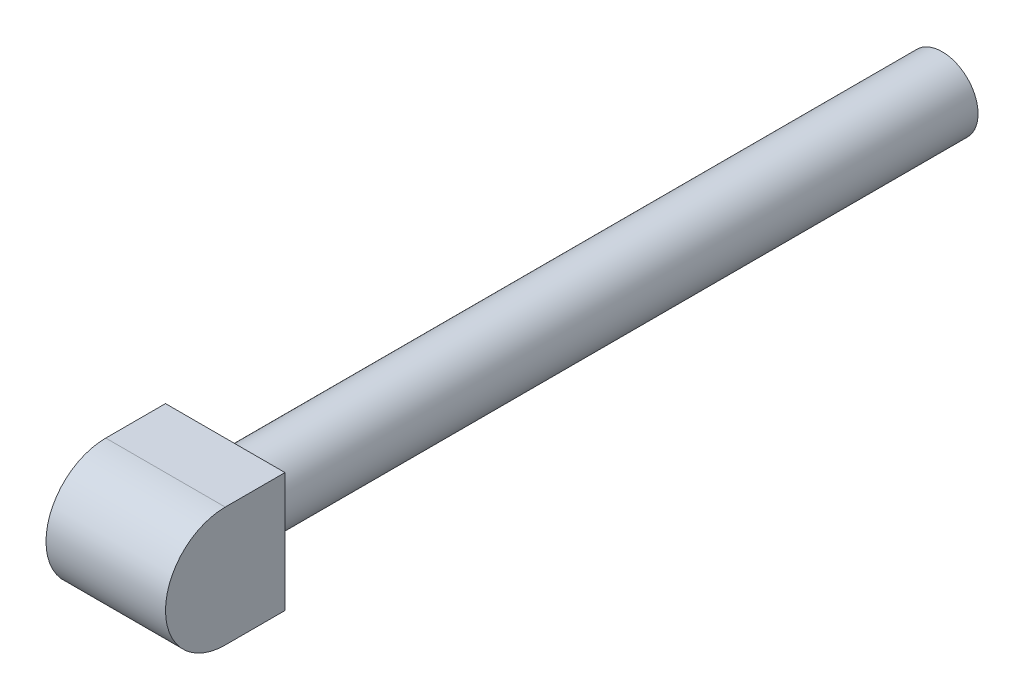
ISO-10303-21;
HEADER;
FILE_DESCRIPTION(('STEP AP214'),'2;1');
FILE_NAME('part.step','',(''),(''),'','','');
FILE_SCHEMA(('AUTOMOTIVE_DESIGN { 1 0 10303 214 1 1 1 1 }'));
ENDSEC;
DATA;
#1=APPLICATION_CONTEXT('core data for automotive mechanical design processes');
#2=APPLICATION_PROTOCOL_DEFINITION('international standard','automotive_design',2000,#1);
#3=PRODUCT_CONTEXT('',#1,'mechanical');
#4=PRODUCT('Part','Part','',(#3));
#5=PRODUCT_RELATED_PRODUCT_CATEGORY('part','',(#4));
#6=PRODUCT_DEFINITION_FORMATION('','',#4);
#7=PRODUCT_DEFINITION_CONTEXT('part definition',#1,'design');
#8=PRODUCT_DEFINITION('design','',#6,#7);
#9=PRODUCT_DEFINITION_SHAPE('','',#8);
#10=(LENGTH_UNIT() NAMED_UNIT(*) SI_UNIT(.MILLI.,.METRE.));
#11=(NAMED_UNIT(*) PLANE_ANGLE_UNIT() SI_UNIT($,.RADIAN.));
#12=(NAMED_UNIT(*) SI_UNIT($,.STERADIAN.) SOLID_ANGLE_UNIT());
#13=UNCERTAINTY_MEASURE_WITH_UNIT(LENGTH_MEASURE(1.E-05),#10,'distance_accuracy_value','');
#14=(GEOMETRIC_REPRESENTATION_CONTEXT(3) GLOBAL_UNCERTAINTY_ASSIGNED_CONTEXT((#13)) GLOBAL_UNIT_ASSIGNED_CONTEXT((#10,
#11,#12)) REPRESENTATION_CONTEXT('',''));
#15=CARTESIAN_POINT('',(0.,0.,0.));
#16=DIRECTION('',(0.,0.,1.));
#17=DIRECTION('',(1.,0.,0.));
#18=AXIS2_PLACEMENT_3D('',#15,#16,#17);
#19=CARTESIAN_POINT('',(-10.,10.,20.));
#20=DIRECTION('',(0.,-1.,0.));
#21=DIRECTION('',(0.,0.,-1.));
#22=AXIS2_PLACEMENT_3D('',#19,#20,#21);
#23=PLANE('',#22);
#24=DIRECTION('',(1.,0.,0.));
#25=VECTOR('',#24,1.);
#26=CARTESIAN_POINT('',(-60.,10.,10.));
#27=LINE('',#26,#25);
#28=CARTESIAN_POINT('',(-10.,10.,10.));
#29=VERTEX_POINT('',#28);
#30=CARTESIAN_POINT('',(10.,10.,10.));
#31=VERTEX_POINT('',#30);
#32=EDGE_CURVE('E82',#29,#31,#27,.T.);
#33=ORIENTED_EDGE('',*,*,#32,.T.);
#34=DIRECTION('',(0.,0.,-1.));
#35=VECTOR('',#34,1.);
#36=CARTESIAN_POINT('',(10.,10.,20.));
#37=LINE('',#36,#35);
#38=CARTESIAN_POINT('',(10.,10.,0.));
#39=VERTEX_POINT('',#38);
#40=EDGE_CURVE('E90',#31,#39,#37,.T.);
#41=ORIENTED_EDGE('',*,*,#40,.T.);
#42=DIRECTION('',(-1.,0.,0.));
#43=VECTOR('',#42,1.);
#44=CARTESIAN_POINT('',(-10.,10.,0.));
#45=LINE('',#44,#43);
#46=CARTESIAN_POINT('',(-10.,10.,0.));
#47=VERTEX_POINT('',#46);
#48=EDGE_CURVE('E99',#39,#47,#45,.T.);
#49=ORIENTED_EDGE('',*,*,#48,.T.);
#50=DIRECTION('',(0.,0.,-1.));
#51=VECTOR('',#50,1.);
#52=CARTESIAN_POINT('',(-10.,10.,20.));
#53=LINE('',#52,#51);
#54=EDGE_CURVE('E58',#29,#47,#53,.T.);
#55=ORIENTED_EDGE('',*,*,#54,.F.);
#56=EDGE_LOOP('',(#33,#41,#49,#55));
#57=FACE_BOUND('',#56,.T.);
#58=ADVANCED_FACE('F34',(#57),#23,.F.);
#59=CARTESIAN_POINT('',(-10.,10.,20.));
#60=DIRECTION('',(1.,0.,0.));
#61=DIRECTION('',(0.,1.,0.));
#62=AXIS2_PLACEMENT_3D('',#59,#60,#61);
#63=PLANE('',#62);
#64=DIRECTION('',(0.,0.,-1.));
#65=VECTOR('',#64,1.);
#66=CARTESIAN_POINT('',(-10.,-10.,20.));
#67=LINE('',#66,#65);
#68=CARTESIAN_POINT('',(-10.,-10.,10.));
#69=VERTEX_POINT('',#68);
#70=CARTESIAN_POINT('',(-10.,-10.,0.));
#71=VERTEX_POINT('',#70);
#72=EDGE_CURVE('E38',#69,#71,#67,.T.);
#73=ORIENTED_EDGE('',*,*,#72,.F.);
#74=CARTESIAN_POINT('',(-10.,0.,10.));
#75=DIRECTION('',(1.,0.,0.));
#76=DIRECTION('',(0.,1.,0.));
#77=AXIS2_PLACEMENT_3D('',#74,#75,#76);
#78=CIRCLE('',#77,10.);
#79=EDGE_CURVE('E78',#69,#29,#78,.F.);
#80=ORIENTED_EDGE('',*,*,#79,.T.);
#81=ORIENTED_EDGE('',*,*,#54,.T.);
#82=DIRECTION('',(0.,-1.,0.));
#83=VECTOR('',#82,1.);
#84=CARTESIAN_POINT('',(-10.,10.,0.));
#85=LINE('',#84,#83);
#86=EDGE_CURVE('E104',#47,#71,#85,.T.);
#87=ORIENTED_EDGE('',*,*,#86,.T.);
#88=EDGE_LOOP('',(#73,#80,#81,#87));
#89=FACE_BOUND('',#88,.T.);
#90=ADVANCED_FACE('F36',(#89),#63,.F.);
#91=CARTESIAN_POINT('',(-10.,-10.,20.));
#92=DIRECTION('',(0.,1.,0.));
#93=DIRECTION('',(0.,0.,1.));
#94=AXIS2_PLACEMENT_3D('',#91,#92,#93);
#95=PLANE('',#94);
#96=DIRECTION('',(0.,0.,-1.));
#97=VECTOR('',#96,1.);
#98=CARTESIAN_POINT('',(10.,-10.,20.));
#99=LINE('',#98,#97);
#100=CARTESIAN_POINT('',(10.,-10.,10.));
#101=VERTEX_POINT('',#100);
#102=CARTESIAN_POINT('',(10.,-10.,0.));
#103=VERTEX_POINT('',#102);
#104=EDGE_CURVE('E88',#101,#103,#99,.T.);
#105=ORIENTED_EDGE('',*,*,#104,.F.);
#106=DIRECTION('',(1.,0.,0.));
#107=VECTOR('',#106,1.);
#108=CARTESIAN_POINT('',(-60.,-10.,10.));
#109=LINE('',#108,#107);
#110=EDGE_CURVE('E76',#69,#101,#109,.T.);
#111=ORIENTED_EDGE('',*,*,#110,.F.);
#112=ORIENTED_EDGE('',*,*,#72,.T.);
#113=DIRECTION('',(1.,0.,0.));
#114=VECTOR('',#113,1.);
#115=CARTESIAN_POINT('',(-10.,-10.,0.));
#116=LINE('',#115,#114);
#117=EDGE_CURVE('E94',#71,#103,#116,.T.);
#118=ORIENTED_EDGE('',*,*,#117,.T.);
#119=EDGE_LOOP('',(#105,#111,#112,#118));
#120=FACE_BOUND('',#119,.T.);
#121=ADVANCED_FACE('F92',(#120),#95,.F.);
#122=CARTESIAN_POINT('',(10.,10.,20.));
#123=DIRECTION('',(-1.,0.,0.));
#124=DIRECTION('',(0.,0.,1.));
#125=AXIS2_PLACEMENT_3D('',#122,#123,#124);
#126=PLANE('',#125);
#127=ORIENTED_EDGE('',*,*,#40,.F.);
#128=CARTESIAN_POINT('',(10.,0.,10.));
#129=DIRECTION('',(-1.,0.,0.));
#130=DIRECTION('',(0.,0.,-1.));
#131=AXIS2_PLACEMENT_3D('',#128,#129,#130);
#132=CIRCLE('',#131,10.);
#133=EDGE_CURVE('E50',#101,#31,#132,.T.);
#134=ORIENTED_EDGE('',*,*,#133,.F.);
#135=ORIENTED_EDGE('',*,*,#104,.T.);
#136=DIRECTION('',(0.,1.,0.));
#137=VECTOR('',#136,1.);
#138=CARTESIAN_POINT('',(10.,10.,0.));
#139=LINE('',#138,#137);
#140=EDGE_CURVE('E101',#103,#39,#139,.T.);
#141=ORIENTED_EDGE('',*,*,#140,.T.);
#142=EDGE_LOOP('',(#127,#134,#135,#141));
#143=FACE_BOUND('',#142,.T.);
#144=ADVANCED_FACE('F86',(#143),#126,.F.);
#145=CARTESIAN_POINT('',(0.,0.,0.));
#146=DIRECTION('',(0.,0.,1.));
#147=DIRECTION('',(1.,0.,0.));
#148=AXIS2_PLACEMENT_3D('',#145,#146,#147);
#149=PLANE('',#148);
#150=CARTESIAN_POINT('',(0.,0.,0.));
#151=DIRECTION('',(0.,0.,-1.));
#152=DIRECTION('',(-1.,0.,0.));
#153=AXIS2_PLACEMENT_3D('',#150,#151,#152);
#154=CIRCLE('',#153,6.);
#155=CARTESIAN_POINT('',(-6.,0.,0.));
#156=VERTEX_POINT('',#155);
#157=EDGE_CURVE('E11',#156,#156,#154,.T.);
#158=ORIENTED_EDGE('',*,*,#157,.F.);
#159=EDGE_LOOP('',(#158));
#160=FACE_BOUND('',#159,.T.);
#161=ORIENTED_EDGE('',*,*,#86,.F.);
#162=ORIENTED_EDGE('',*,*,#48,.F.);
#163=ORIENTED_EDGE('',*,*,#140,.F.);
#164=ORIENTED_EDGE('',*,*,#117,.F.);
#165=EDGE_LOOP('',(#161,#162,#163,#164));
#166=FACE_BOUND('',#165,.T.);
#167=ADVANCED_FACE('F114',(#160,#166),#149,.F.);
#168=CARTESIAN_POINT('',(0.,0.,-120.));
#169=DIRECTION('',(0.,0.,1.));
#170=DIRECTION('',(1.,0.,0.));
#171=AXIS2_PLACEMENT_3D('',#168,#169,#170);
#172=CYLINDRICAL_SURFACE('',#171,6.);
#173=CARTESIAN_POINT('',(0.,0.,-120.));
#174=DIRECTION('',(0.,0.,-1.));
#175=DIRECTION('',(-1.,0.,0.));
#176=AXIS2_PLACEMENT_3D('',#173,#174,#175);
#177=CIRCLE('',#176,6.);
#178=CARTESIAN_POINT('',(-6.,0.,-120.));
#179=VERTEX_POINT('',#178);
#180=EDGE_CURVE('E105',#179,#179,#177,.T.);
#181=ORIENTED_EDGE('',*,*,#180,.F.);
#182=EDGE_LOOP('',(#181));
#183=FACE_BOUND('',#182,.T.);
#184=ORIENTED_EDGE('',*,*,#157,.T.);
#185=EDGE_LOOP('',(#184));
#186=FACE_BOUND('',#185,.T.);
#187=ADVANCED_FACE('F130',(#183,#186),#172,.T.);
#188=CARTESIAN_POINT('',(0.,0.,-120.));
#189=DIRECTION('',(0.,0.,-1.));
#190=DIRECTION('',(-1.,0.,0.));
#191=AXIS2_PLACEMENT_3D('',#188,#189,#190);
#192=PLANE('',#191);
#193=ORIENTED_EDGE('',*,*,#180,.T.);
#194=EDGE_LOOP('',(#193));
#195=FACE_BOUND('',#194,.T.);
#196=ADVANCED_FACE('F135',(#195),#192,.T.);
#197=CARTESIAN_POINT('',(-60.,0.,10.));
#198=DIRECTION('',(1.,0.,0.));
#199=DIRECTION('',(0.,0.,-1.));
#200=AXIS2_PLACEMENT_3D('',#197,#198,#199);
#201=CYLINDRICAL_SURFACE('',#200,10.);
#202=ORIENTED_EDGE('',*,*,#110,.T.);
#203=ORIENTED_EDGE('',*,*,#133,.T.);
#204=ORIENTED_EDGE('',*,*,#32,.F.);
#205=ORIENTED_EDGE('',*,*,#79,.F.);
#206=EDGE_LOOP('',(#202,#203,#204,#205));
#207=FACE_BOUND('',#206,.T.);
#208=ADVANCED_FACE('F77',(#207),#201,.T.);
#209=CLOSED_SHELL('',(#58,#90,#121,#144,#167,#187,#196,#208));
#210=MANIFOLD_SOLID_BREP('B2',#209);
#211=ADVANCED_BREP_SHAPE_REPRESENTATION('',(#18,#210),#14);
#212=SHAPE_DEFINITION_REPRESENTATION(#9,#211);
ENDSEC;
END-ISO-10303-21;
